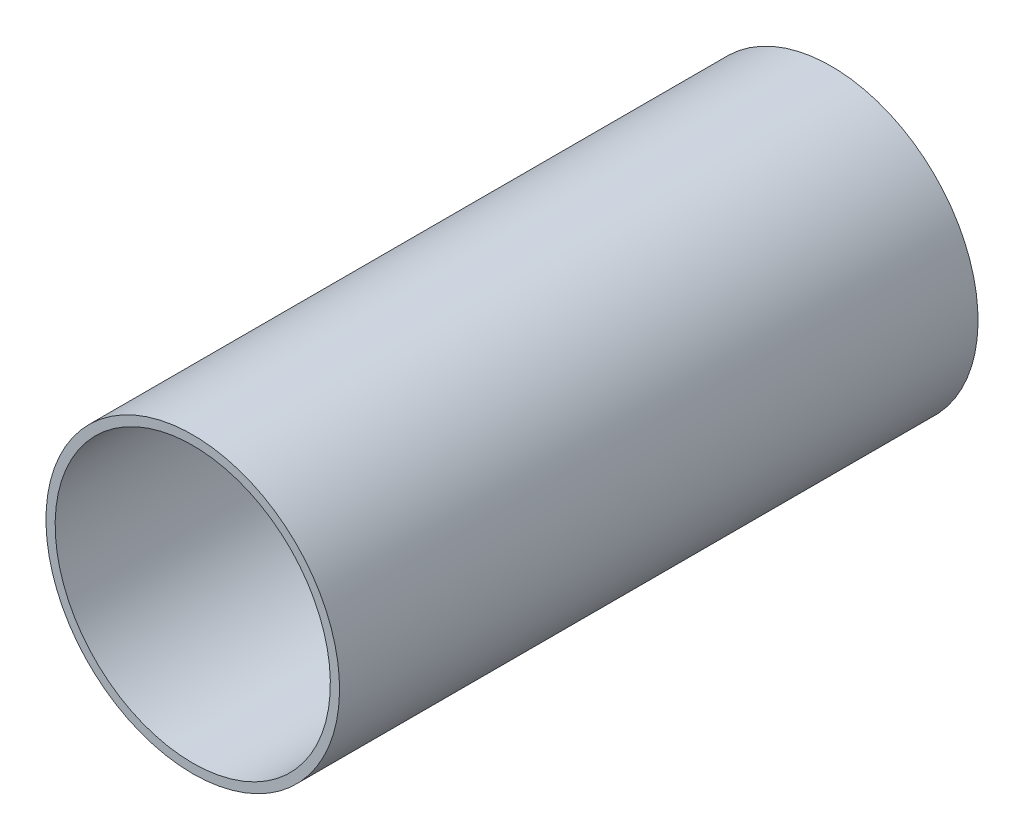
ISO-10303-21;
HEADER;
FILE_DESCRIPTION(('STEP AP214'),'2;1');
FILE_NAME('part.step','',(''),(''),'','','');
FILE_SCHEMA(('AUTOMOTIVE_DESIGN { 1 0 10303 214 1 1 1 1 }'));
ENDSEC;
DATA;
#1=APPLICATION_CONTEXT('core data for automotive mechanical design processes');
#2=APPLICATION_PROTOCOL_DEFINITION('international standard','automotive_design',2000,#1);
#3=PRODUCT_CONTEXT('',#1,'mechanical');
#4=PRODUCT('Part','Part','',(#3));
#5=PRODUCT_RELATED_PRODUCT_CATEGORY('part','',(#4));
#6=PRODUCT_DEFINITION_FORMATION('','',#4);
#7=PRODUCT_DEFINITION_CONTEXT('part definition',#1,'design');
#8=PRODUCT_DEFINITION('design','',#6,#7);
#9=PRODUCT_DEFINITION_SHAPE('','',#8);
#10=(LENGTH_UNIT() NAMED_UNIT(*) SI_UNIT(.MILLI.,.METRE.));
#11=(NAMED_UNIT(*) PLANE_ANGLE_UNIT() SI_UNIT($,.RADIAN.));
#12=(NAMED_UNIT(*) SI_UNIT($,.STERADIAN.) SOLID_ANGLE_UNIT());
#13=UNCERTAINTY_MEASURE_WITH_UNIT(LENGTH_MEASURE(1.E-05),#10,'distance_accuracy_value','');
#14=(GEOMETRIC_REPRESENTATION_CONTEXT(3) GLOBAL_UNCERTAINTY_ASSIGNED_CONTEXT((#13)) GLOBAL_UNIT_ASSIGNED_CONTEXT((#10,
#11,#12)) REPRESENTATION_CONTEXT('',''));
#15=CARTESIAN_POINT('',(0.,0.,0.));
#16=DIRECTION('',(0.,0.,1.));
#17=DIRECTION('',(1.,0.,0.));
#18=AXIS2_PLACEMENT_3D('',#15,#16,#17);
#19=CARTESIAN_POINT('',(154.94,-103.632,-0.045));
#20=DIRECTION('',(0.,0.,-1.));
#21=DIRECTION('',(0.,-1.,0.));
#22=AXIS2_PLACEMENT_3D('',#19,#20,#21);
#23=CYLINDRICAL_SURFACE('',#22,0.375);
#24=CARTESIAN_POINT('',(154.94,-103.632,-0.035));
#25=DIRECTION('',(0.,0.,-1.));
#26=DIRECTION('',(0.,-1.,0.));
#27=AXIS2_PLACEMENT_3D('',#24,#25,#26);
#28=CIRCLE('',#27,0.375);
#29=CARTESIAN_POINT('',(154.94,-104.007,-0.035));
#30=VERTEX_POINT('',#29);
#31=EDGE_CURVE('E63',#30,#30,#28,.T.);
#32=ORIENTED_EDGE('',*,*,#31,.T.);
#33=DIRECTION('',(0.,0.,1.));
#34=VECTOR('',#33,1.);
#35=CARTESIAN_POINT('',(154.94,-104.007,-0.045));
#36=LINE('',#35,#34);
#37=CARTESIAN_POINT('',(154.94,-104.007,1.705));
#38=VERTEX_POINT('',#37);
#39=EDGE_CURVE('E11',#30,#38,#36,.T.);
#40=ORIENTED_EDGE('',*,*,#39,.T.);
#41=CARTESIAN_POINT('',(154.94,-103.632,1.705));
#42=DIRECTION('',(0.,0.,-1.));
#43=DIRECTION('',(0.,-1.,0.));
#44=AXIS2_PLACEMENT_3D('',#41,#42,#43);
#45=CIRCLE('',#44,0.375);
#46=EDGE_CURVE('E25',#38,#38,#45,.T.);
#47=ORIENTED_EDGE('',*,*,#46,.F.);
#48=ORIENTED_EDGE('',*,*,#39,.F.);
#49=EDGE_LOOP('',(#32,#40,#47,#48));
#50=FACE_BOUND('',#49,.T.);
#51=ADVANCED_FACE('F17',(#50),#23,.F.);
#52=CARTESIAN_POINT('',(154.94,-104.032,1.705));
#53=DIRECTION('',(0.,0.,1.));
#54=DIRECTION('',(1.,0.,0.));
#55=AXIS2_PLACEMENT_3D('',#52,#53,#54);
#56=PLANE('',#55);
#57=ORIENTED_EDGE('',*,*,#46,.T.);
#58=EDGE_LOOP('',(#57));
#59=FACE_BOUND('',#58,.T.);
#60=CARTESIAN_POINT('',(154.94,-103.632,1.705));
#61=DIRECTION('',(0.,0.,1.));
#62=DIRECTION('',(0.,-1.,0.));
#63=AXIS2_PLACEMENT_3D('',#60,#61,#62);
#64=CIRCLE('',#63,0.4);
#65=CARTESIAN_POINT('',(154.94,-104.032,1.705));
#66=VERTEX_POINT('',#65);
#67=EDGE_CURVE('E55',#66,#66,#64,.T.);
#68=ORIENTED_EDGE('',*,*,#67,.T.);
#69=EDGE_LOOP('',(#68));
#70=FACE_BOUND('',#69,.T.);
#71=ADVANCED_FACE('F72',(#59,#70),#56,.T.);
#72=CARTESIAN_POINT('',(154.94,-104.032,-0.035));
#73=DIRECTION('',(0.,0.,1.));
#74=DIRECTION('',(1.,0.,0.));
#75=AXIS2_PLACEMENT_3D('',#72,#73,#74);
#76=PLANE('',#75);
#77=ORIENTED_EDGE('',*,*,#31,.F.);
#78=EDGE_LOOP('',(#77));
#79=FACE_BOUND('',#78,.T.);
#80=CARTESIAN_POINT('',(154.94,-103.632,-0.035));
#81=DIRECTION('',(0.,0.,1.));
#82=DIRECTION('',(0.,-1.,0.));
#83=AXIS2_PLACEMENT_3D('',#80,#81,#82);
#84=CIRCLE('',#83,0.4);
#85=CARTESIAN_POINT('',(154.94,-104.032,-0.035));
#86=VERTEX_POINT('',#85);
#87=EDGE_CURVE('E54',#86,#86,#84,.T.);
#88=ORIENTED_EDGE('',*,*,#87,.F.);
#89=EDGE_LOOP('',(#88));
#90=FACE_BOUND('',#89,.T.);
#91=ADVANCED_FACE('F81',(#79,#90),#76,.F.);
#92=CARTESIAN_POINT('',(154.94,-103.632,-0.035));
#93=DIRECTION('',(0.,0.,-1.));
#94=DIRECTION('',(0.,-1.,0.));
#95=AXIS2_PLACEMENT_3D('',#92,#93,#94);
#96=CYLINDRICAL_SURFACE('',#95,0.4);
#97=ORIENTED_EDGE('',*,*,#87,.T.);
#98=DIRECTION('',(0.,0.,1.));
#99=VECTOR('',#98,1.);
#100=CARTESIAN_POINT('',(154.94,-104.032,-0.035));
#101=LINE('',#100,#99);
#102=EDGE_CURVE('E51',#86,#66,#101,.T.);
#103=ORIENTED_EDGE('',*,*,#102,.T.);
#104=ORIENTED_EDGE('',*,*,#67,.F.);
#105=ORIENTED_EDGE('',*,*,#102,.F.);
#106=EDGE_LOOP('',(#97,#103,#104,#105));
#107=FACE_BOUND('',#106,.T.);
#108=ADVANCED_FACE('F52',(#107),#96,.T.);
#109=CLOSED_SHELL('',(#51,#71,#91,#108));
#110=MANIFOLD_SOLID_BREP('B1',#109);
#111=ADVANCED_BREP_SHAPE_REPRESENTATION('',(#18,#110),#14);
#112=SHAPE_DEFINITION_REPRESENTATION(#9,#111);
ENDSEC;
END-ISO-10303-21;
